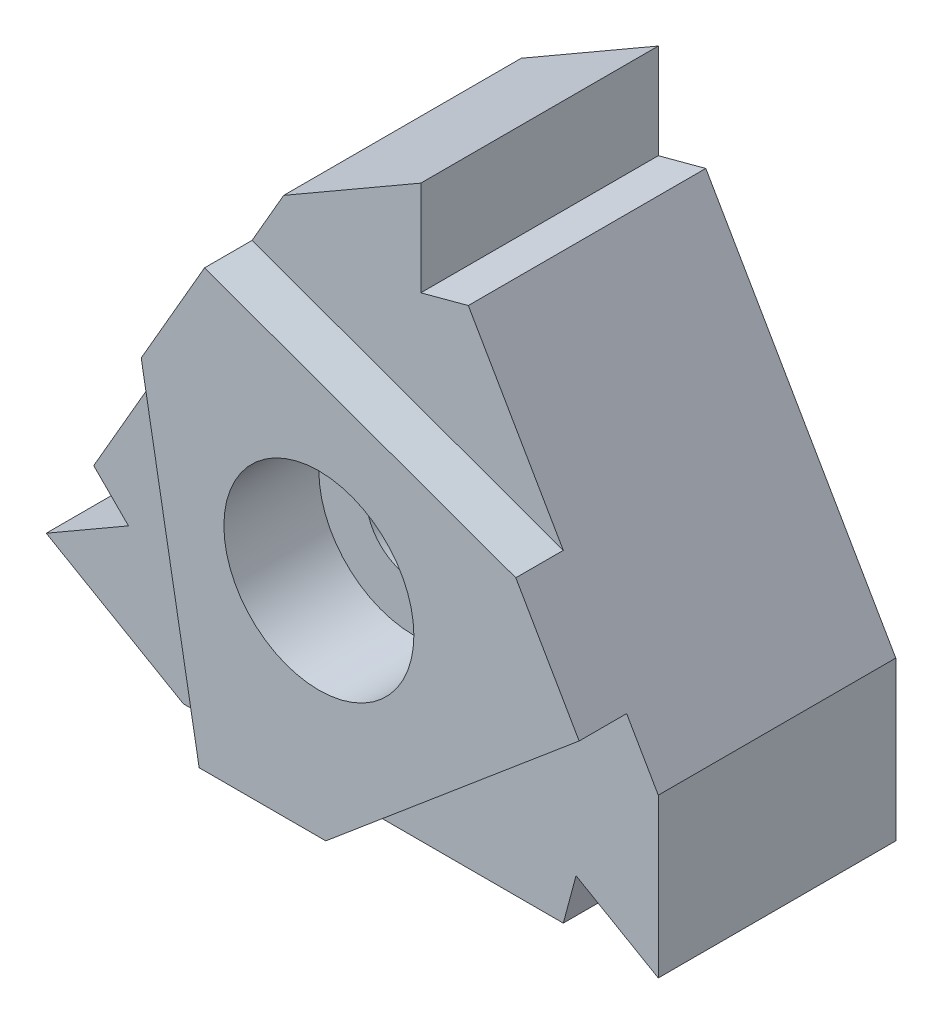
ISO-10303-21;
HEADER;
FILE_DESCRIPTION(('STEP AP214'),'2;1');
FILE_NAME('part.step','',(''),(''),'','','');
FILE_SCHEMA(('AUTOMOTIVE_DESIGN { 1 0 10303 214 1 1 1 1 }'));
ENDSEC;
DATA;
#1=APPLICATION_CONTEXT('core data for automotive mechanical design processes');
#2=APPLICATION_PROTOCOL_DEFINITION('international standard','automotive_design',2000,#1);
#3=PRODUCT_CONTEXT('',#1,'mechanical');
#4=PRODUCT('Part','Part','',(#3));
#5=PRODUCT_RELATED_PRODUCT_CATEGORY('part','',(#4));
#6=PRODUCT_DEFINITION_FORMATION('','',#4);
#7=PRODUCT_DEFINITION_CONTEXT('part definition',#1,'design');
#8=PRODUCT_DEFINITION('design','',#6,#7);
#9=PRODUCT_DEFINITION_SHAPE('','',#8);
#10=(LENGTH_UNIT() NAMED_UNIT(*) SI_UNIT(.MILLI.,.METRE.));
#11=(NAMED_UNIT(*) PLANE_ANGLE_UNIT() SI_UNIT($,.RADIAN.));
#12=(NAMED_UNIT(*) SI_UNIT($,.STERADIAN.) SOLID_ANGLE_UNIT());
#13=UNCERTAINTY_MEASURE_WITH_UNIT(LENGTH_MEASURE(1.E-05),#10,'distance_accuracy_value','');
#14=(GEOMETRIC_REPRESENTATION_CONTEXT(3) GLOBAL_UNCERTAINTY_ASSIGNED_CONTEXT((#13)) GLOBAL_UNIT_ASSIGNED_CONTEXT((#10,
#11,#12)) REPRESENTATION_CONTEXT('',''));
#15=CARTESIAN_POINT('',(0.,0.,0.));
#16=DIRECTION('',(0.,0.,1.));
#17=DIRECTION('',(1.,0.,0.));
#18=AXIS2_PLACEMENT_3D('',#15,#16,#17);
#19=CARTESIAN_POINT('',(-28.0027212464095,1.49999999999997,9.));
#20=DIRECTION('',(-0.965925826289068,0.258819045102522,0.));
#21=DIRECTION('',(-0.258819045102522,-0.965925826289068,0.));
#22=AXIS2_PLACEMENT_3D('',#19,#20,#21);
#23=PLANE('',#22);
#24=DIRECTION('',(0.258819045102522,0.965925826289068,0.));
#25=VECTOR('',#24,1.);
#26=CARTESIAN_POINT('',(-28.4046450350561,0.,7.5));
#27=LINE('',#26,#25);
#28=CARTESIAN_POINT('',(-28.4046450350561,0.,7.5));
#29=VERTEX_POINT('',#28);
#30=CARTESIAN_POINT('',(-28.0027212464095,1.49999999999997,7.5));
#31=VERTEX_POINT('',#30);
#32=EDGE_CURVE('E295',#29,#31,#27,.T.);
#33=ORIENTED_EDGE('',*,*,#32,.F.);
#34=DIRECTION('',(0.,0.,-1.));
#35=VECTOR('',#34,1.);
#36=CARTESIAN_POINT('',(-28.4046450350561,0.,9.));
#37=LINE('',#36,#35);
#38=CARTESIAN_POINT('',(-28.4046450350561,0.,0.));
#39=VERTEX_POINT('',#38);
#40=EDGE_CURVE('E44',#29,#39,#37,.T.);
#41=ORIENTED_EDGE('',*,*,#40,.T.);
#42=DIRECTION('',(0.258819045102522,0.965925826289068,0.));
#43=VECTOR('',#42,1.);
#44=CARTESIAN_POINT('',(-28.0027212464095,1.49999999999997,0.));
#45=LINE('',#44,#43);
#46=CARTESIAN_POINT('',(-28.0027212464095,1.49999999999997,0.));
#47=VERTEX_POINT('',#46);
#48=EDGE_CURVE('E242',#39,#47,#45,.T.);
#49=ORIENTED_EDGE('',*,*,#48,.T.);
#50=DIRECTION('',(0.,0.,-1.));
#51=VECTOR('',#50,1.);
#52=CARTESIAN_POINT('',(-28.0027212464095,1.49999999999997,9.));
#53=LINE('',#52,#51);
#54=EDGE_CURVE('E288',#31,#47,#53,.T.);
#55=ORIENTED_EDGE('',*,*,#54,.F.);
#56=EDGE_LOOP('',(#33,#41,#49,#55));
#57=FACE_BOUND('',#56,.T.);
#58=ADVANCED_FACE('F36',(#57),#23,.F.);
#59=CARTESIAN_POINT('',(-25.4046450350562,0.,9.));
#60=DIRECTION('',(0.500000000000017,0.866025403784429,0.));
#61=DIRECTION('',(-0.866025403784429,0.500000000000017,0.));
#62=AXIS2_PLACEMENT_3D('',#59,#60,#61);
#63=PLANE('',#62);
#64=DIRECTION('',(0.866025403784429,-0.500000000000017,0.));
#65=VECTOR('',#64,1.);
#66=CARTESIAN_POINT('',(-28.0027212464095,1.49999999999997,7.5));
#67=LINE('',#66,#65);
#68=CARTESIAN_POINT('',(-25.4046450350562,0.,7.5));
#69=VERTEX_POINT('',#68);
#70=EDGE_CURVE('E184',#31,#69,#67,.T.);
#71=ORIENTED_EDGE('',*,*,#70,.F.);
#72=ORIENTED_EDGE('',*,*,#54,.T.);
#73=DIRECTION('',(0.866025403784429,-0.500000000000017,0.));
#74=VECTOR('',#73,1.);
#75=CARTESIAN_POINT('',(-25.4046450350562,0.,0.));
#76=LINE('',#75,#74);
#77=CARTESIAN_POINT('',(-25.4046450350562,0.,0.));
#78=VERTEX_POINT('',#77);
#79=EDGE_CURVE('E245',#47,#78,#76,.T.);
#80=ORIENTED_EDGE('',*,*,#79,.T.);
#81=DIRECTION('',(0.,0.,-1.));
#82=VECTOR('',#81,1.);
#83=CARTESIAN_POINT('',(-25.4046450350562,0.,9.));
#84=LINE('',#83,#82);
#85=EDGE_CURVE('E286',#69,#78,#84,.T.);
#86=ORIENTED_EDGE('',*,*,#85,.F.);
#87=EDGE_LOOP('',(#71,#72,#80,#86));
#88=FACE_BOUND('',#87,.T.);
#89=ADVANCED_FACE('F309',(#88),#63,.F.);
#90=CARTESIAN_POINT('',(-25.404645035056,5.00000000000006,9.));
#91=DIRECTION('',(-1.,0.,0.));
#92=DIRECTION('',(0.,-1.,0.));
#93=AXIS2_PLACEMENT_3D('',#90,#91,#92);
#94=PLANE('',#93);
#95=DIRECTION('',(0.,1.,0.));
#96=VECTOR('',#95,1.);
#97=CARTESIAN_POINT('',(-25.4046450350562,0.,7.5));
#98=LINE('',#97,#96);
#99=CARTESIAN_POINT('',(-25.404645035056,5.00000000000006,7.5));
#100=VERTEX_POINT('',#99);
#101=EDGE_CURVE('E172',#69,#100,#98,.T.);
#102=ORIENTED_EDGE('',*,*,#101,.F.);
#103=ORIENTED_EDGE('',*,*,#85,.T.);
#104=DIRECTION('',(0.,1.,0.));
#105=VECTOR('',#104,1.);
#106=CARTESIAN_POINT('',(-25.404645035056,5.00000000000006,0.));
#107=LINE('',#106,#105);
#108=CARTESIAN_POINT('',(-25.404645035056,5.00000000000006,0.));
#109=VERTEX_POINT('',#108);
#110=EDGE_CURVE('E248',#78,#109,#107,.T.);
#111=ORIENTED_EDGE('',*,*,#110,.T.);
#112=DIRECTION('',(0.,0.,-1.));
#113=VECTOR('',#112,1.);
#114=CARTESIAN_POINT('',(-25.404645035056,5.00000000000006,9.));
#115=LINE('',#114,#113);
#116=EDGE_CURVE('E284',#100,#109,#115,.T.);
#117=ORIENTED_EDGE('',*,*,#116,.F.);
#118=EDGE_LOOP('',(#102,#103,#111,#117));
#119=FACE_BOUND('',#118,.T.);
#120=ADVANCED_FACE('F369',(#119),#94,.F.);
#121=CARTESIAN_POINT('',(-32.9046450350559,14.990381056767,9.));
#122=DIRECTION('',(0.258819045102527,-0.965925826289067,0.));
#123=DIRECTION('',(0.965925826289067,0.258819045102527,0.));
#124=AXIS2_PLACEMENT_3D('',#121,#122,#123);
#125=PLANE('',#124);
#126=DIRECTION('',(-0.965925826289067,-0.258819045102527,0.));
#127=VECTOR('',#126,1.);
#128=CARTESIAN_POINT('',(-31.4046450350562,15.3923048454136,7.5));
#129=LINE('',#128,#127);
#130=CARTESIAN_POINT('',(-31.4046450350562,15.3923048454136,7.5));
#131=VERTEX_POINT('',#130);
#132=CARTESIAN_POINT('',(-32.9046450350559,14.990381056767,7.5));
#133=VERTEX_POINT('',#132);
#134=EDGE_CURVE('E196',#131,#133,#129,.T.);
#135=ORIENTED_EDGE('',*,*,#134,.F.);
#136=DIRECTION('',(0.,0.,-1.));
#137=VECTOR('',#136,1.);
#138=CARTESIAN_POINT('',(-31.4046450350562,15.3923048454136,9.));
#139=LINE('',#138,#137);
#140=CARTESIAN_POINT('',(-31.4046450350562,15.3923048454136,0.));
#141=VERTEX_POINT('',#140);
#142=EDGE_CURVE('E282',#131,#141,#139,.T.);
#143=ORIENTED_EDGE('',*,*,#142,.T.);
#144=DIRECTION('',(-0.965925826289067,-0.258819045102527,0.));
#145=VECTOR('',#144,1.);
#146=CARTESIAN_POINT('',(-32.9046450350559,14.990381056767,0.));
#147=LINE('',#146,#145);
#148=CARTESIAN_POINT('',(-32.9046450350559,14.990381056767,0.));
#149=VERTEX_POINT('',#148);
#150=EDGE_CURVE('E254',#141,#149,#147,.T.);
#151=ORIENTED_EDGE('',*,*,#150,.T.);
#152=DIRECTION('',(0.,0.,-1.));
#153=VECTOR('',#152,1.);
#154=CARTESIAN_POINT('',(-32.9046450350559,14.990381056767,9.));
#155=LINE('',#154,#153);
#156=EDGE_CURVE('E280',#133,#149,#155,.T.);
#157=ORIENTED_EDGE('',*,*,#156,.F.);
#158=EDGE_LOOP('',(#135,#143,#151,#157));
#159=FACE_BOUND('',#158,.T.);
#160=ADVANCED_FACE('F365',(#159),#125,.F.);
#161=CARTESIAN_POINT('',(-32.9046450350559,17.990381056767,9.));
#162=DIRECTION('',(-1.,0.,0.));
#163=DIRECTION('',(0.,-1.,0.));
#164=AXIS2_PLACEMENT_3D('',#161,#162,#163);
#165=PLANE('',#164);
#166=DIRECTION('',(0.,1.,0.));
#167=VECTOR('',#166,1.);
#168=CARTESIAN_POINT('',(-32.9046450350559,14.990381056767,7.5));
#169=LINE('',#168,#167);
#170=CARTESIAN_POINT('',(-32.9046450350559,17.990381056767,7.5));
#171=VERTEX_POINT('',#170);
#172=EDGE_CURVE('E198',#133,#171,#169,.T.);
#173=ORIENTED_EDGE('',*,*,#172,.F.);
#174=ORIENTED_EDGE('',*,*,#156,.T.);
#175=DIRECTION('',(0.,1.,0.));
#176=VECTOR('',#175,1.);
#177=CARTESIAN_POINT('',(-32.9046450350559,17.990381056767,0.));
#178=LINE('',#177,#176);
#179=CARTESIAN_POINT('',(-32.9046450350559,17.990381056767,0.));
#180=VERTEX_POINT('',#179);
#181=EDGE_CURVE('E257',#149,#180,#178,.T.);
#182=ORIENTED_EDGE('',*,*,#181,.T.);
#183=DIRECTION('',(0.,0.,-1.));
#184=VECTOR('',#183,1.);
#185=CARTESIAN_POINT('',(-32.9046450350559,17.990381056767,9.));
#186=LINE('',#185,#184);
#187=EDGE_CURVE('E278',#171,#180,#186,.T.);
#188=ORIENTED_EDGE('',*,*,#187,.F.);
#189=EDGE_LOOP('',(#173,#174,#182,#188));
#190=FACE_BOUND('',#189,.T.);
#191=ADVANCED_FACE('F360',(#190),#165,.F.);
#192=CARTESIAN_POINT('',(-37.2347720539781,15.490381056767,9.));
#193=DIRECTION('',(0.500000000000003,-0.866025403784437,0.));
#194=DIRECTION('',(0.866025403784437,0.500000000000003,0.));
#195=AXIS2_PLACEMENT_3D('',#192,#193,#194);
#196=PLANE('',#195);
#197=DIRECTION('',(-0.866025403784437,-0.500000000000003,0.));
#198=VECTOR('',#197,1.);
#199=CARTESIAN_POINT('',(-32.9046450350559,17.990381056767,7.5));
#200=LINE('',#199,#198);
#201=CARTESIAN_POINT('',(-37.2347720539781,15.490381056767,7.5));
#202=VERTEX_POINT('',#201);
#203=EDGE_CURVE('E200',#171,#202,#200,.T.);
#204=ORIENTED_EDGE('',*,*,#203,.F.);
#205=ORIENTED_EDGE('',*,*,#187,.T.);
#206=DIRECTION('',(-0.866025403784437,-0.500000000000003,0.));
#207=VECTOR('',#206,1.);
#208=CARTESIAN_POINT('',(-37.2347720539781,15.490381056767,0.));
#209=LINE('',#208,#207);
#210=CARTESIAN_POINT('',(-37.2347720539781,15.490381056767,0.));
#211=VERTEX_POINT('',#210);
#212=EDGE_CURVE('E260',#180,#211,#209,.T.);
#213=ORIENTED_EDGE('',*,*,#212,.T.);
#214=DIRECTION('',(0.,0.,-1.));
#215=VECTOR('',#214,1.);
#216=CARTESIAN_POINT('',(-37.2347720539781,15.490381056767,9.));
#217=LINE('',#216,#215);
#218=EDGE_CURVE('E276',#202,#211,#217,.T.);
#219=ORIENTED_EDGE('',*,*,#218,.F.);
#220=EDGE_LOOP('',(#204,#205,#213,#219));
#221=FACE_BOUND('',#220,.T.);
#222=ADVANCED_FACE('F356',(#221),#196,.F.);
#223=CARTESIAN_POINT('',(-40.4046450350561,0.,9.));
#224=DIRECTION('',(0.499999999999994,0.866025403784442,0.));
#225=DIRECTION('',(-0.866025403784442,0.499999999999994,0.));
#226=AXIS2_PLACEMENT_3D('',#223,#224,#225);
#227=PLANE('',#226);
#228=DIRECTION('',(0.866025403784443,-0.499999999999993,0.));
#229=VECTOR('',#228,1.);
#230=CARTESIAN_POINT('',(-44.7347720539784,2.49999999999996,7.5));
#231=LINE('',#230,#229);
#232=CARTESIAN_POINT('',(-44.7347720539784,2.49999999999996,7.5));
#233=VERTEX_POINT('',#232);
#234=CARTESIAN_POINT('',(-40.4046450350561,0.,7.5));
#235=VERTEX_POINT('',#234);
#236=EDGE_CURVE('E219',#233,#235,#231,.T.);
#237=ORIENTED_EDGE('',*,*,#236,.F.);
#238=DIRECTION('',(0.,0.,-1.));
#239=VECTOR('',#238,1.);
#240=CARTESIAN_POINT('',(-44.7347720539784,2.49999999999997,9.));
#241=LINE('',#240,#239);
#242=CARTESIAN_POINT('',(-44.7347720539784,2.49999999999997,0.));
#243=VERTEX_POINT('',#242);
#244=EDGE_CURVE('E236',#233,#243,#241,.T.);
#245=ORIENTED_EDGE('',*,*,#244,.T.);
#246=DIRECTION('',(0.866025403784442,-0.499999999999994,0.));
#247=VECTOR('',#246,1.);
#248=CARTESIAN_POINT('',(-40.4046450350561,0.,0.));
#249=LINE('',#248,#247);
#250=CARTESIAN_POINT('',(-40.4046450350561,0.,0.));
#251=VERTEX_POINT('',#250);
#252=EDGE_CURVE('E227',#243,#251,#249,.T.);
#253=ORIENTED_EDGE('',*,*,#252,.T.);
#254=DIRECTION('',(0.,0.,-1.));
#255=VECTOR('',#254,1.);
#256=CARTESIAN_POINT('',(-40.4046450350561,0.,9.));
#257=LINE('',#256,#255);
#258=EDGE_CURVE('E11',#235,#251,#257,.T.);
#259=ORIENTED_EDGE('',*,*,#258,.F.);
#260=EDGE_LOOP('',(#237,#245,#253,#259));
#261=FACE_BOUND('',#260,.T.);
#262=ADVANCED_FACE('F38',(#261),#227,.F.);
#263=CARTESIAN_POINT('',(-42.136695842625,3.99999999999998,9.));
#264=DIRECTION('',(0.707106781186544,0.707106781186551,0.));
#265=DIRECTION('',(-0.707106781186551,0.707106781186544,0.));
#266=AXIS2_PLACEMENT_3D('',#263,#264,#265);
#267=PLANE('',#266);
#268=DIRECTION('',(0.707106781186552,-0.707106781186543,0.));
#269=VECTOR('',#268,1.);
#270=CARTESIAN_POINT('',(-43.2347720539784,5.09807621135328,7.5));
#271=LINE('',#270,#269);
#272=CARTESIAN_POINT('',(-43.2347720539784,5.09807621135328,7.5));
#273=VERTEX_POINT('',#272);
#274=CARTESIAN_POINT('',(-42.136695842625,3.99999999999998,7.5));
#275=VERTEX_POINT('',#274);
#276=EDGE_CURVE('E215',#273,#275,#271,.T.);
#277=ORIENTED_EDGE('',*,*,#276,.F.);
#278=DIRECTION('',(0.,0.,-1.));
#279=VECTOR('',#278,1.);
#280=CARTESIAN_POINT('',(-43.2347720539784,5.09807621135328,9.));
#281=LINE('',#280,#279);
#282=CARTESIAN_POINT('',(-43.2347720539784,5.09807621135328,0.));
#283=VERTEX_POINT('',#282);
#284=EDGE_CURVE('E274',#273,#283,#281,.T.);
#285=ORIENTED_EDGE('',*,*,#284,.T.);
#286=DIRECTION('',(0.707106781186551,-0.707106781186544,0.));
#287=VECTOR('',#286,1.);
#288=CARTESIAN_POINT('',(-42.136695842625,3.99999999999998,0.));
#289=LINE('',#288,#287);
#290=CARTESIAN_POINT('',(-42.136695842625,3.99999999999998,0.));
#291=VERTEX_POINT('',#290);
#292=EDGE_CURVE('E266',#283,#291,#289,.T.);
#293=ORIENTED_EDGE('',*,*,#292,.T.);
#294=DIRECTION('',(0.,0.,-1.));
#295=VECTOR('',#294,1.);
#296=CARTESIAN_POINT('',(-42.136695842625,3.99999999999998,9.));
#297=LINE('',#296,#295);
#298=EDGE_CURVE('E272',#275,#291,#297,.T.);
#299=ORIENTED_EDGE('',*,*,#298,.F.);
#300=EDGE_LOOP('',(#277,#285,#293,#299));
#301=FACE_BOUND('',#300,.T.);
#302=ADVANCED_FACE('F341',(#301),#267,.F.);
#303=CARTESIAN_POINT('',(-44.7347720539784,2.49999999999997,9.));
#304=DIRECTION('',(0.500000000000002,-0.866025403784437,0.));
#305=DIRECTION('',(0.866025403784437,0.500000000000003,0.));
#306=AXIS2_PLACEMENT_3D('',#303,#304,#305);
#307=PLANE('',#306);
#308=DIRECTION('',(-0.866025403784437,-0.500000000000003,0.));
#309=VECTOR('',#308,1.);
#310=CARTESIAN_POINT('',(-42.136695842625,3.99999999999998,7.5));
#311=LINE('',#310,#309);
#312=EDGE_CURVE('E217',#275,#233,#311,.T.);
#313=ORIENTED_EDGE('',*,*,#312,.F.);
#314=ORIENTED_EDGE('',*,*,#298,.T.);
#315=DIRECTION('',(-0.866025403784437,-0.500000000000003,0.));
#316=VECTOR('',#315,1.);
#317=CARTESIAN_POINT('',(-44.7347720539784,2.49999999999997,0.));
#318=LINE('',#317,#316);
#319=EDGE_CURVE('E232',#291,#243,#318,.T.);
#320=ORIENTED_EDGE('',*,*,#319,.T.);
#321=ORIENTED_EDGE('',*,*,#244,.F.);
#322=EDGE_LOOP('',(#313,#314,#320,#321));
#323=FACE_BOUND('',#322,.T.);
#324=ADVANCED_FACE('F345',(#323),#307,.F.);
#325=CARTESIAN_POINT('',(-40.4046450350561,0.,9.));
#326=DIRECTION('',(0.,1.,0.));
#327=DIRECTION('',(-1.,0.,0.));
#328=AXIS2_PLACEMENT_3D('',#325,#326,#327);
#329=PLANE('',#328);
#330=DIRECTION('',(1.,0.,0.));
#331=VECTOR('',#330,1.);
#332=CARTESIAN_POINT('',(-34.4046450350561,0.,7.5));
#333=LINE('',#332,#331);
#334=CARTESIAN_POINT('',(-34.4046450350561,0.,7.5));
#335=VERTEX_POINT('',#334);
#336=EDGE_CURVE('E166',#335,#29,#333,.T.);
#337=ORIENTED_EDGE('',*,*,#336,.F.);
#338=DIRECTION('',(0.,0.,1.));
#339=VECTOR('',#338,1.);
#340=CARTESIAN_POINT('',(-34.4046450350561,0.,7.5));
#341=LINE('',#340,#339);
#342=CARTESIAN_POINT('',(-34.4046450350561,0.,9.));
#343=VERTEX_POINT('',#342);
#344=EDGE_CURVE('E163',#335,#343,#341,.T.);
#345=ORIENTED_EDGE('',*,*,#344,.T.);
#346=DIRECTION('',(1.,0.,0.));
#347=VECTOR('',#346,1.);
#348=CARTESIAN_POINT('',(-40.4046450350561,0.,9.));
#349=LINE('',#348,#347);
#350=CARTESIAN_POINT('',(-38.4046450350561,0.,9.));
#351=VERTEX_POINT('',#350);
#352=EDGE_CURVE('E229',#351,#343,#349,.T.);
#353=ORIENTED_EDGE('',*,*,#352,.F.);
#354=DIRECTION('',(0.,0.,1.));
#355=VECTOR('',#354,1.);
#356=CARTESIAN_POINT('',(-38.4046450350561,0.,7.5));
#357=LINE('',#356,#355);
#358=CARTESIAN_POINT('',(-38.4046450350561,0.,7.5));
#359=VERTEX_POINT('',#358);
#360=EDGE_CURVE('E221',#359,#351,#357,.T.);
#361=ORIENTED_EDGE('',*,*,#360,.F.);
#362=DIRECTION('',(1.,0.,0.));
#363=VECTOR('',#362,1.);
#364=CARTESIAN_POINT('',(-40.4046450350561,0.,7.5));
#365=LINE('',#364,#363);
#366=EDGE_CURVE('E207',#235,#359,#365,.T.);
#367=ORIENTED_EDGE('',*,*,#366,.F.);
#368=ORIENTED_EDGE('',*,*,#258,.T.);
#369=DIRECTION('',(1.,0.,0.));
#370=VECTOR('',#369,1.);
#371=CARTESIAN_POINT('',(-40.4046450350561,0.,0.));
#372=LINE('',#371,#370);
#373=EDGE_CURVE('E239',#251,#39,#372,.T.);
#374=ORIENTED_EDGE('',*,*,#373,.T.);
#375=ORIENTED_EDGE('',*,*,#40,.F.);
#376=EDGE_LOOP('',(#337,#345,#353,#361,#367,#368,#374,#375));
#377=FACE_BOUND('',#376,.T.);
#378=ADVANCED_FACE('F298',(#377),#329,.F.);
#379=CARTESIAN_POINT('',(-25.404645035056,5.00000000000006,9.));
#380=DIRECTION('',(-0.866025403784437,-0.500000000000002,0.));
#381=DIRECTION('',(0.500000000000002,-0.866025403784438,0.));
#382=AXIS2_PLACEMENT_3D('',#379,#380,#381);
#383=PLANE('',#382);
#384=DIRECTION('',(-0.500000000000002,0.866025403784437,0.));
#385=VECTOR('',#384,1.);
#386=CARTESIAN_POINT('',(-25.404645035056,5.00000000000006,9.));
#387=LINE('',#386,#385);
#388=CARTESIAN_POINT('',(-26.404645035056,6.73205080756893,9.));
#389=VERTEX_POINT('',#388);
#390=CARTESIAN_POINT('',(-28.4046450350561,10.1961524227068,9.));
#391=VERTEX_POINT('',#390);
#392=EDGE_CURVE('E180',#389,#391,#387,.T.);
#393=ORIENTED_EDGE('',*,*,#392,.F.);
#394=DIRECTION('',(0.,0.,1.));
#395=VECTOR('',#394,1.);
#396=CARTESIAN_POINT('',(-26.404645035056,6.73205080756893,7.5));
#397=LINE('',#396,#395);
#398=CARTESIAN_POINT('',(-26.404645035056,6.73205080756893,7.5));
#399=VERTEX_POINT('',#398);
#400=EDGE_CURVE('E51',#399,#389,#397,.T.);
#401=ORIENTED_EDGE('',*,*,#400,.F.);
#402=DIRECTION('',(-0.500000000000004,0.866025403784436,0.));
#403=VECTOR('',#402,1.);
#404=CARTESIAN_POINT('',(-25.404645035056,5.00000000000006,7.5));
#405=LINE('',#404,#403);
#406=EDGE_CURVE('E167',#100,#399,#405,.T.);
#407=ORIENTED_EDGE('',*,*,#406,.F.);
#408=ORIENTED_EDGE('',*,*,#116,.T.);
#409=DIRECTION('',(-0.500000000000002,0.866025403784437,0.));
#410=VECTOR('',#409,1.);
#411=CARTESIAN_POINT('',(-25.404645035056,5.00000000000006,0.));
#412=LINE('',#411,#410);
#413=EDGE_CURVE('E251',#109,#141,#412,.T.);
#414=ORIENTED_EDGE('',*,*,#413,.T.);
#415=ORIENTED_EDGE('',*,*,#142,.F.);
#416=DIRECTION('',(-0.500000000000001,0.866025403784438,0.));
#417=VECTOR('',#416,1.);
#418=CARTESIAN_POINT('',(-28.4046450350561,10.1961524227068,7.5));
#419=LINE('',#418,#417);
#420=CARTESIAN_POINT('',(-28.4046450350561,10.1961524227068,7.5));
#421=VERTEX_POINT('',#420);
#422=EDGE_CURVE('E194',#421,#131,#419,.T.);
#423=ORIENTED_EDGE('',*,*,#422,.F.);
#424=DIRECTION('',(0.,0.,1.));
#425=VECTOR('',#424,1.);
#426=CARTESIAN_POINT('',(-28.4046450350561,10.1961524227068,7.5));
#427=LINE('',#426,#425);
#428=EDGE_CURVE('E203',#421,#391,#427,.T.);
#429=ORIENTED_EDGE('',*,*,#428,.T.);
#430=EDGE_LOOP('',(#393,#401,#407,#408,#414,#415,#423,#429));
#431=FACE_BOUND('',#430,.T.);
#432=ADVANCED_FACE('F178',(#431),#383,.F.);
#433=CARTESIAN_POINT('',(-37.2347720539781,15.490381056767,9.));
#434=DIRECTION('',(0.866025403784439,-0.5,0.));
#435=DIRECTION('',(0.5,0.866025403784439,0.));
#436=AXIS2_PLACEMENT_3D('',#433,#434,#435);
#437=PLANE('',#436);
#438=DIRECTION('',(-0.5,-0.866025403784439,0.));
#439=VECTOR('',#438,1.);
#440=CARTESIAN_POINT('',(-37.2347720539781,15.490381056767,9.));
#441=LINE('',#440,#439);
#442=CARTESIAN_POINT('',(-38.2347720539781,13.7583302491981,9.));
#443=VERTEX_POINT('',#442);
#444=CARTESIAN_POINT('',(-40.2347720539782,10.2942286340601,9.));
#445=VERTEX_POINT('',#444);
#446=EDGE_CURVE('E234',#443,#445,#441,.T.);
#447=ORIENTED_EDGE('',*,*,#446,.F.);
#448=DIRECTION('',(0.,0.,1.));
#449=VECTOR('',#448,1.);
#450=CARTESIAN_POINT('',(-38.2347720539781,13.7583302491981,7.5));
#451=LINE('',#450,#449);
#452=CARTESIAN_POINT('',(-38.2347720539781,13.7583302491981,7.5));
#453=VERTEX_POINT('',#452);
#454=EDGE_CURVE('E59',#453,#443,#451,.T.);
#455=ORIENTED_EDGE('',*,*,#454,.F.);
#456=DIRECTION('',(-0.500000000000004,-0.866025403784437,0.));
#457=VECTOR('',#456,1.);
#458=CARTESIAN_POINT('',(-37.2347720539781,15.490381056767,7.5));
#459=LINE('',#458,#457);
#460=EDGE_CURVE('E188',#202,#453,#459,.T.);
#461=ORIENTED_EDGE('',*,*,#460,.F.);
#462=ORIENTED_EDGE('',*,*,#218,.T.);
#463=DIRECTION('',(-0.5,-0.866025403784439,0.));
#464=VECTOR('',#463,1.);
#465=CARTESIAN_POINT('',(-37.2347720539781,15.490381056767,0.));
#466=LINE('',#465,#464);
#467=EDGE_CURVE('E263',#211,#283,#466,.T.);
#468=ORIENTED_EDGE('',*,*,#467,.T.);
#469=ORIENTED_EDGE('',*,*,#284,.F.);
#470=DIRECTION('',(-0.5,-0.866025403784439,0.));
#471=VECTOR('',#470,1.);
#472=CARTESIAN_POINT('',(-40.2347720539782,10.2942286340601,7.5));
#473=LINE('',#472,#471);
#474=CARTESIAN_POINT('',(-40.2347720539782,10.2942286340601,7.5));
#475=VERTEX_POINT('',#474);
#476=EDGE_CURVE('E213',#475,#273,#473,.T.);
#477=ORIENTED_EDGE('',*,*,#476,.F.);
#478=DIRECTION('',(0.,0.,1.));
#479=VECTOR('',#478,1.);
#480=CARTESIAN_POINT('',(-40.2347720539782,10.2942286340601,7.5));
#481=LINE('',#480,#479);
#482=EDGE_CURVE('E224',#475,#445,#481,.T.);
#483=ORIENTED_EDGE('',*,*,#482,.T.);
#484=EDGE_LOOP('',(#447,#455,#461,#462,#468,#469,#477,#483));
#485=FACE_BOUND('',#484,.T.);
#486=ADVANCED_FACE('F333',(#485),#437,.F.);
#487=CARTESIAN_POINT('',(0.,0.,9.));
#488=DIRECTION('',(0.,0.,1.));
#489=DIRECTION('',(1.,0.,0.));
#490=AXIS2_PLACEMENT_3D('',#487,#488,#489);
#491=PLANE('',#490);
#492=CARTESIAN_POINT('',(-34.6241418536448,7.01212520351794,9.));
#493=DIRECTION('',(0.,0.,1.));
#494=DIRECTION('',(1.,0.,0.));
#495=AXIS2_PLACEMENT_3D('',#492,#493,#494);
#496=CIRCLE('',#495,3.);
#497=CARTESIAN_POINT('',(-31.6241418536448,7.01212520351794,9.));
#498=VERTEX_POINT('',#497);
#499=EDGE_CURVE('E545',#498,#498,#496,.T.);
#500=ORIENTED_EDGE('',*,*,#499,.F.);
#501=EDGE_LOOP('',(#500));
#502=FACE_BOUND('',#501,.T.);
#503=DIRECTION('',(-0.765136933874664,-0.643867589198958,0.));
#504=VECTOR('',#503,1.);
#505=CARTESIAN_POINT('',(-26.404645035056,6.73205080756893,9.));
#506=LINE('',#505,#504);
#507=EDGE_CURVE('E175',#389,#343,#506,.T.);
#508=ORIENTED_EDGE('',*,*,#507,.F.);
#509=ORIENTED_EDGE('',*,*,#392,.T.);
#510=DIRECTION('',(0.940174155857066,-0.340694227509732,0.));
#511=VECTOR('',#510,1.);
#512=CARTESIAN_POINT('',(-38.2347720539781,13.7583302491981,9.));
#513=LINE('',#512,#511);
#514=EDGE_CURVE('E182',#443,#391,#513,.T.);
#515=ORIENTED_EDGE('',*,*,#514,.F.);
#516=ORIENTED_EDGE('',*,*,#446,.T.);
#517=DIRECTION('',(-0.175037221982401,0.984561816708673,0.));
#518=VECTOR('',#517,1.);
#519=CARTESIAN_POINT('',(-38.4046450350561,0.,9.));
#520=LINE('',#519,#518);
#521=EDGE_CURVE('E205',#351,#445,#520,.T.);
#522=ORIENTED_EDGE('',*,*,#521,.F.);
#523=ORIENTED_EDGE('',*,*,#352,.T.);
#524=EDGE_LOOP('',(#508,#509,#515,#516,#522,#523));
#525=FACE_BOUND('',#524,.T.);
#526=ADVANCED_FACE('F327',(#502,#525),#491,.T.);
#527=CARTESIAN_POINT('',(0.,0.,0.));
#528=DIRECTION('',(0.,0.,1.));
#529=DIRECTION('',(1.,0.,0.));
#530=AXIS2_PLACEMENT_3D('',#527,#528,#529);
#531=PLANE('',#530);
#532=CARTESIAN_POINT('',(-34.6241418536448,7.01212520351794,0.));
#533=DIRECTION('',(0.,0.,1.));
#534=DIRECTION('',(1.,0.,0.));
#535=AXIS2_PLACEMENT_3D('',#532,#533,#534);
#536=CIRCLE('',#535,1.5);
#537=CARTESIAN_POINT('',(-33.1241418536448,7.01212520351794,0.));
#538=VERTEX_POINT('',#537);
#539=EDGE_CURVE('E313',#538,#538,#536,.T.);
#540=ORIENTED_EDGE('',*,*,#539,.T.);
#541=EDGE_LOOP('',(#540));
#542=FACE_BOUND('',#541,.T.);
#543=ORIENTED_EDGE('',*,*,#252,.F.);
#544=ORIENTED_EDGE('',*,*,#319,.F.);
#545=ORIENTED_EDGE('',*,*,#292,.F.);
#546=ORIENTED_EDGE('',*,*,#467,.F.);
#547=ORIENTED_EDGE('',*,*,#212,.F.);
#548=ORIENTED_EDGE('',*,*,#181,.F.);
#549=ORIENTED_EDGE('',*,*,#150,.F.);
#550=ORIENTED_EDGE('',*,*,#413,.F.);
#551=ORIENTED_EDGE('',*,*,#110,.F.);
#552=ORIENTED_EDGE('',*,*,#79,.F.);
#553=ORIENTED_EDGE('',*,*,#48,.F.);
#554=ORIENTED_EDGE('',*,*,#373,.F.);
#555=EDGE_LOOP('',(#543,#544,#545,#546,#547,#548,#549,#550,#551,#552,#553,#554));
#556=FACE_BOUND('',#555,.T.);
#557=ADVANCED_FACE('F303',(#542,#556),#531,.F.);
#558=CARTESIAN_POINT('',(-38.4046450350561,0.,7.5));
#559=DIRECTION('',(0.984561816708674,0.175037221982401,0.));
#560=DIRECTION('',(-0.175037221982401,0.984561816708674,0.));
#561=AXIS2_PLACEMENT_3D('',#558,#559,#560);
#562=PLANE('',#561);
#563=ORIENTED_EDGE('',*,*,#521,.T.);
#564=ORIENTED_EDGE('',*,*,#482,.F.);
#565=DIRECTION('',(-0.175037221982401,0.984561816708673,0.));
#566=VECTOR('',#565,1.);
#567=CARTESIAN_POINT('',(-38.4046450350561,0.,7.5));
#568=LINE('',#567,#566);
#569=EDGE_CURVE('E210',#359,#475,#568,.T.);
#570=ORIENTED_EDGE('',*,*,#569,.F.);
#571=ORIENTED_EDGE('',*,*,#360,.T.);
#572=EDGE_LOOP('',(#563,#564,#570,#571));
#573=FACE_BOUND('',#572,.T.);
#574=ADVANCED_FACE('F330',(#573),#562,.F.);
#575=CARTESIAN_POINT('',(0.,0.,7.5));
#576=DIRECTION('',(0.,0.,1.));
#577=DIRECTION('',(1.,0.,0.));
#578=AXIS2_PLACEMENT_3D('',#575,#576,#577);
#579=PLANE('',#578);
#580=ORIENTED_EDGE('',*,*,#366,.T.);
#581=ORIENTED_EDGE('',*,*,#569,.T.);
#582=ORIENTED_EDGE('',*,*,#476,.T.);
#583=ORIENTED_EDGE('',*,*,#276,.T.);
#584=ORIENTED_EDGE('',*,*,#312,.T.);
#585=ORIENTED_EDGE('',*,*,#236,.T.);
#586=EDGE_LOOP('',(#580,#581,#582,#583,#584,#585));
#587=FACE_BOUND('',#586,.T.);
#588=ADVANCED_FACE('F337',(#587),#579,.T.);
#589=CARTESIAN_POINT('',(-38.2347720539781,13.7583302491981,7.5));
#590=DIRECTION('',(-0.340694227509732,-0.940174155857066,0.));
#591=DIRECTION('',(0.940174155857066,-0.340694227509732,0.));
#592=AXIS2_PLACEMENT_3D('',#589,#590,#591);
#593=PLANE('',#592);
#594=ORIENTED_EDGE('',*,*,#514,.T.);
#595=ORIENTED_EDGE('',*,*,#428,.F.);
#596=DIRECTION('',(0.940174155857066,-0.340694227509732,0.));
#597=VECTOR('',#596,1.);
#598=CARTESIAN_POINT('',(-38.2347720539781,13.7583302491981,7.5));
#599=LINE('',#598,#597);
#600=EDGE_CURVE('E191',#453,#421,#599,.T.);
#601=ORIENTED_EDGE('',*,*,#600,.F.);
#602=ORIENTED_EDGE('',*,*,#454,.T.);
#603=EDGE_LOOP('',(#594,#595,#601,#602));
#604=FACE_BOUND('',#603,.T.);
#605=ADVANCED_FACE('F460',(#604),#593,.F.);
#606=CARTESIAN_POINT('',(0.,0.,7.5));
#607=DIRECTION('',(0.,0.,1.));
#608=DIRECTION('',(1.,0.,0.));
#609=AXIS2_PLACEMENT_3D('',#606,#607,#608);
#610=PLANE('',#609);
#611=ORIENTED_EDGE('',*,*,#460,.T.);
#612=ORIENTED_EDGE('',*,*,#600,.T.);
#613=ORIENTED_EDGE('',*,*,#422,.T.);
#614=ORIENTED_EDGE('',*,*,#134,.T.);
#615=ORIENTED_EDGE('',*,*,#172,.T.);
#616=ORIENTED_EDGE('',*,*,#203,.T.);
#617=EDGE_LOOP('',(#611,#612,#613,#614,#615,#616));
#618=FACE_BOUND('',#617,.T.);
#619=ADVANCED_FACE('F469',(#618),#610,.T.);
#620=CARTESIAN_POINT('',(-26.404645035056,6.73205080756893,7.5));
#621=DIRECTION('',(-0.643867589198958,0.765136933874664,0.));
#622=DIRECTION('',(-0.765136933874664,-0.643867589198958,0.));
#623=AXIS2_PLACEMENT_3D('',#620,#621,#622);
#624=PLANE('',#623);
#625=ORIENTED_EDGE('',*,*,#507,.T.);
#626=ORIENTED_EDGE('',*,*,#344,.F.);
#627=DIRECTION('',(-0.765136933874664,-0.643867589198958,0.));
#628=VECTOR('',#627,1.);
#629=CARTESIAN_POINT('',(-26.404645035056,6.73205080756893,7.5));
#630=LINE('',#629,#628);
#631=EDGE_CURVE('E159',#399,#335,#630,.T.);
#632=ORIENTED_EDGE('',*,*,#631,.F.);
#633=ORIENTED_EDGE('',*,*,#400,.T.);
#634=EDGE_LOOP('',(#625,#626,#632,#633));
#635=FACE_BOUND('',#634,.T.);
#636=ADVANCED_FACE('F161',(#635),#624,.F.);
#637=CARTESIAN_POINT('',(0.,0.,7.5));
#638=DIRECTION('',(0.,0.,1.));
#639=DIRECTION('',(1.,0.,0.));
#640=AXIS2_PLACEMENT_3D('',#637,#638,#639);
#641=PLANE('',#640);
#642=ORIENTED_EDGE('',*,*,#406,.T.);
#643=ORIENTED_EDGE('',*,*,#631,.T.);
#644=ORIENTED_EDGE('',*,*,#336,.T.);
#645=ORIENTED_EDGE('',*,*,#32,.T.);
#646=ORIENTED_EDGE('',*,*,#70,.T.);
#647=ORIENTED_EDGE('',*,*,#101,.T.);
#648=EDGE_LOOP('',(#642,#643,#644,#645,#646,#647));
#649=FACE_BOUND('',#648,.T.);
#650=ADVANCED_FACE('F170',(#649),#641,.T.);
#651=CARTESIAN_POINT('',(-34.6241418536448,7.01212520351794,9.));
#652=DIRECTION('',(0.,0.,1.));
#653=DIRECTION('',(1.,0.,0.));
#654=AXIS2_PLACEMENT_3D('',#651,#652,#653);
#655=CYLINDRICAL_SURFACE('',#654,1.5);
#656=ORIENTED_EDGE('',*,*,#539,.F.);
#657=EDGE_LOOP('',(#656));
#658=FACE_BOUND('',#657,.T.);
#659=CARTESIAN_POINT('',(-34.6241418536448,7.01212520351794,6.));
#660=DIRECTION('',(0.,0.,1.));
#661=DIRECTION('',(1.,0.,0.));
#662=AXIS2_PLACEMENT_3D('',#659,#660,#661);
#663=CIRCLE('',#662,1.5);
#664=CARTESIAN_POINT('',(-33.1241418536448,7.01212520351794,6.));
#665=VERTEX_POINT('',#664);
#666=EDGE_CURVE('E315',#665,#665,#663,.T.);
#667=ORIENTED_EDGE('',*,*,#666,.T.);
#668=EDGE_LOOP('',(#667));
#669=FACE_BOUND('',#668,.T.);
#670=ADVANCED_FACE('F495',(#658,#669),#655,.F.);
#671=CARTESIAN_POINT('',(-33.1241418536448,7.01212520351794,6.));
#672=DIRECTION('',(0.,0.,-1.));
#673=DIRECTION('',(-1.,0.,0.));
#674=AXIS2_PLACEMENT_3D('',#671,#672,#673);
#675=PLANE('',#674);
#676=ORIENTED_EDGE('',*,*,#666,.F.);
#677=EDGE_LOOP('',(#676));
#678=FACE_BOUND('',#677,.T.);
#679=CARTESIAN_POINT('',(-34.6241418536448,7.01212520351794,6.));
#680=DIRECTION('',(0.,0.,1.));
#681=DIRECTION('',(1.,0.,0.));
#682=AXIS2_PLACEMENT_3D('',#679,#680,#681);
#683=CIRCLE('',#682,3.);
#684=CARTESIAN_POINT('',(-31.6241418536448,7.01212520351794,6.));
#685=VERTEX_POINT('',#684);
#686=EDGE_CURVE('E320',#685,#685,#683,.T.);
#687=ORIENTED_EDGE('',*,*,#686,.T.);
#688=EDGE_LOOP('',(#687));
#689=FACE_BOUND('',#688,.T.);
#690=ADVANCED_FACE('F516',(#678,#689),#675,.F.);
#691=CARTESIAN_POINT('',(-34.6241418536448,7.01212520351794,9.));
#692=DIRECTION('',(0.,0.,1.));
#693=DIRECTION('',(1.,0.,0.));
#694=AXIS2_PLACEMENT_3D('',#691,#692,#693);
#695=CYLINDRICAL_SURFACE('',#694,3.);
#696=ORIENTED_EDGE('',*,*,#686,.F.);
#697=EDGE_LOOP('',(#696));
#698=FACE_BOUND('',#697,.T.);
#699=ORIENTED_EDGE('',*,*,#499,.T.);
#700=EDGE_LOOP('',(#699));
#701=FACE_BOUND('',#700,.T.);
#702=ADVANCED_FACE('F526',(#698,#701),#695,.F.);
#703=CLOSED_SHELL('',(#58,#89,#120,#160,#191,#222,#262,#302,#324,#378,#432,#486,#526,#557,#574,
#588,#605,#619,#636,#650,#670,#690,#702));
#704=MANIFOLD_SOLID_BREP('B2',#703);
#705=ADVANCED_BREP_SHAPE_REPRESENTATION('',(#18,#704),#14);
#706=SHAPE_DEFINITION_REPRESENTATION(#9,#705);
ENDSEC;
END-ISO-10303-21;
